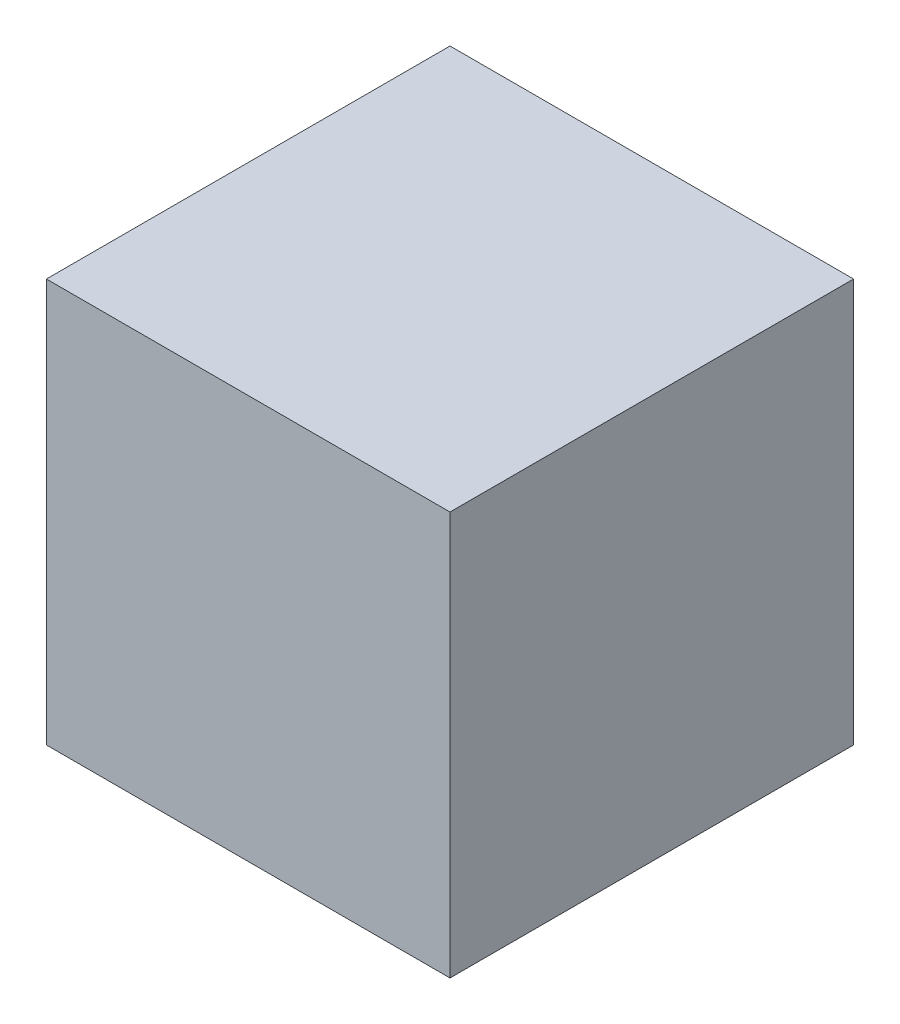
ISO-10303-21;
HEADER;
FILE_DESCRIPTION(('STEP AP214'),'2;1');
FILE_NAME('part.step','',(''),(''),'','','');
FILE_SCHEMA(('AUTOMOTIVE_DESIGN { 1 0 10303 214 1 1 1 1 }'));
ENDSEC;
DATA;
#1=APPLICATION_CONTEXT('core data for automotive mechanical design processes');
#2=APPLICATION_PROTOCOL_DEFINITION('international standard','automotive_design',2000,#1);
#3=PRODUCT_CONTEXT('',#1,'mechanical');
#4=PRODUCT('Part','Part','',(#3));
#5=PRODUCT_RELATED_PRODUCT_CATEGORY('part','',(#4));
#6=PRODUCT_DEFINITION_FORMATION('','',#4);
#7=PRODUCT_DEFINITION_CONTEXT('part definition',#1,'design');
#8=PRODUCT_DEFINITION('design','',#6,#7);
#9=PRODUCT_DEFINITION_SHAPE('','',#8);
#10=(LENGTH_UNIT() NAMED_UNIT(*) SI_UNIT(.MILLI.,.METRE.));
#11=(NAMED_UNIT(*) PLANE_ANGLE_UNIT() SI_UNIT($,.RADIAN.));
#12=(NAMED_UNIT(*) SI_UNIT($,.STERADIAN.) SOLID_ANGLE_UNIT());
#13=UNCERTAINTY_MEASURE_WITH_UNIT(LENGTH_MEASURE(1.E-05),#10,'distance_accuracy_value','');
#14=(GEOMETRIC_REPRESENTATION_CONTEXT(3) GLOBAL_UNCERTAINTY_ASSIGNED_CONTEXT((#13)) GLOBAL_UNIT_ASSIGNED_CONTEXT((#10,
#11,#12)) REPRESENTATION_CONTEXT('',''));
#15=CARTESIAN_POINT('',(0.,0.,0.));
#16=DIRECTION('',(0.,0.,1.));
#17=DIRECTION('',(1.,0.,0.));
#18=AXIS2_PLACEMENT_3D('',#15,#16,#17);
#19=CARTESIAN_POINT('',(-0.127,-0.127,0.));
#20=DIRECTION('',(-1.,0.,0.));
#21=DIRECTION('',(0.,1.,0.));
#22=AXIS2_PLACEMENT_3D('',#19,#20,#21);
#23=PLANE('',#22);
#24=DIRECTION('',(0.,0.,1.));
#25=VECTOR('',#24,1.);
#26=CARTESIAN_POINT('',(-0.127,-0.127,0.));
#27=LINE('',#26,#25);
#28=CARTESIAN_POINT('',(-0.127,-0.127,0.));
#29=VERTEX_POINT('',#28);
#30=CARTESIAN_POINT('',(-0.127,-0.127,0.254));
#31=VERTEX_POINT('',#30);
#32=EDGE_CURVE('E11',#29,#31,#27,.T.);
#33=ORIENTED_EDGE('',*,*,#32,.T.);
#34=DIRECTION('',(0.,1.,0.));
#35=VECTOR('',#34,1.);
#36=CARTESIAN_POINT('',(-0.127,-0.127,0.254));
#37=LINE('',#36,#35);
#38=CARTESIAN_POINT('',(-0.127,0.127,0.254));
#39=VERTEX_POINT('',#38);
#40=EDGE_CURVE('E24',#31,#39,#37,.T.);
#41=ORIENTED_EDGE('',*,*,#40,.T.);
#42=DIRECTION('',(0.,0.,1.));
#43=VECTOR('',#42,1.);
#44=CARTESIAN_POINT('',(-0.127,0.127,0.));
#45=LINE('',#44,#43);
#46=CARTESIAN_POINT('',(-0.127,0.127,0.));
#47=VERTEX_POINT('',#46);
#48=EDGE_CURVE('E85',#47,#39,#45,.T.);
#49=ORIENTED_EDGE('',*,*,#48,.F.);
#50=DIRECTION('',(0.,1.,0.));
#51=VECTOR('',#50,1.);
#52=CARTESIAN_POINT('',(-0.127,-0.127,0.));
#53=LINE('',#52,#51);
#54=EDGE_CURVE('E83',#29,#47,#53,.T.);
#55=ORIENTED_EDGE('',*,*,#54,.F.);
#56=EDGE_LOOP('',(#33,#41,#49,#55));
#57=FACE_BOUND('',#56,.T.);
#58=ADVANCED_FACE('F17',(#57),#23,.T.);
#59=CARTESIAN_POINT('',(-0.127,0.127,0.));
#60=DIRECTION('',(0.,1.,0.));
#61=DIRECTION('',(1.,0.,0.));
#62=AXIS2_PLACEMENT_3D('',#59,#60,#61);
#63=PLANE('',#62);
#64=ORIENTED_EDGE('',*,*,#48,.T.);
#65=DIRECTION('',(1.,0.,0.));
#66=VECTOR('',#65,1.);
#67=CARTESIAN_POINT('',(-0.127,0.127,0.254));
#68=LINE('',#67,#66);
#69=CARTESIAN_POINT('',(0.127,0.127,0.254));
#70=VERTEX_POINT('',#69);
#71=EDGE_CURVE('E81',#39,#70,#68,.T.);
#72=ORIENTED_EDGE('',*,*,#71,.T.);
#73=DIRECTION('',(0.,0.,1.));
#74=VECTOR('',#73,1.);
#75=CARTESIAN_POINT('',(0.127,0.127,0.));
#76=LINE('',#75,#74);
#77=CARTESIAN_POINT('',(0.127,0.127,0.));
#78=VERTEX_POINT('',#77);
#79=EDGE_CURVE('E79',#78,#70,#76,.T.);
#80=ORIENTED_EDGE('',*,*,#79,.F.);
#81=DIRECTION('',(1.,0.,0.));
#82=VECTOR('',#81,1.);
#83=CARTESIAN_POINT('',(-0.127,0.127,0.));
#84=LINE('',#83,#82);
#85=EDGE_CURVE('E70',#47,#78,#84,.T.);
#86=ORIENTED_EDGE('',*,*,#85,.F.);
#87=EDGE_LOOP('',(#64,#72,#80,#86));
#88=FACE_BOUND('',#87,.T.);
#89=ADVANCED_FACE('F90',(#88),#63,.T.);
#90=CARTESIAN_POINT('',(0.127,0.127,0.));
#91=DIRECTION('',(1.,0.,0.));
#92=DIRECTION('',(0.,-1.,0.));
#93=AXIS2_PLACEMENT_3D('',#90,#91,#92);
#94=PLANE('',#93);
#95=ORIENTED_EDGE('',*,*,#79,.T.);
#96=DIRECTION('',(0.,-1.,0.));
#97=VECTOR('',#96,1.);
#98=CARTESIAN_POINT('',(0.127,0.127,0.254));
#99=LINE('',#98,#97);
#100=CARTESIAN_POINT('',(0.127,-0.127,0.254));
#101=VERTEX_POINT('',#100);
#102=EDGE_CURVE('E60',#70,#101,#99,.T.);
#103=ORIENTED_EDGE('',*,*,#102,.T.);
#104=DIRECTION('',(0.,0.,1.));
#105=VECTOR('',#104,1.);
#106=CARTESIAN_POINT('',(0.127,-0.127,0.));
#107=LINE('',#106,#105);
#108=CARTESIAN_POINT('',(0.127,-0.127,0.));
#109=VERTEX_POINT('',#108);
#110=EDGE_CURVE('E54',#109,#101,#107,.T.);
#111=ORIENTED_EDGE('',*,*,#110,.F.);
#112=DIRECTION('',(0.,-1.,0.));
#113=VECTOR('',#112,1.);
#114=CARTESIAN_POINT('',(0.127,0.127,0.));
#115=LINE('',#114,#113);
#116=EDGE_CURVE('E58',#78,#109,#115,.T.);
#117=ORIENTED_EDGE('',*,*,#116,.F.);
#118=EDGE_LOOP('',(#95,#103,#111,#117));
#119=FACE_BOUND('',#118,.T.);
#120=ADVANCED_FACE('F57',(#119),#94,.T.);
#121=CARTESIAN_POINT('',(0.127,-0.127,0.));
#122=DIRECTION('',(0.,-1.,0.));
#123=DIRECTION('',(-1.,0.,0.));
#124=AXIS2_PLACEMENT_3D('',#121,#122,#123);
#125=PLANE('',#124);
#126=ORIENTED_EDGE('',*,*,#110,.T.);
#127=DIRECTION('',(-1.,0.,0.));
#128=VECTOR('',#127,1.);
#129=CARTESIAN_POINT('',(0.127,-0.127,0.254));
#130=LINE('',#129,#128);
#131=EDGE_CURVE('E71',#101,#31,#130,.T.);
#132=ORIENTED_EDGE('',*,*,#131,.T.);
#133=ORIENTED_EDGE('',*,*,#32,.F.);
#134=DIRECTION('',(-1.,0.,0.));
#135=VECTOR('',#134,1.);
#136=CARTESIAN_POINT('',(0.127,-0.127,0.));
#137=LINE('',#136,#135);
#138=EDGE_CURVE('E68',#109,#29,#137,.T.);
#139=ORIENTED_EDGE('',*,*,#138,.F.);
#140=EDGE_LOOP('',(#126,#132,#133,#139));
#141=FACE_BOUND('',#140,.T.);
#142=ADVANCED_FACE('F73',(#141),#125,.T.);
#143=CARTESIAN_POINT('',(0.,0.,0.));
#144=DIRECTION('',(0.,0.,-1.));
#145=DIRECTION('',(-1.,0.,0.));
#146=AXIS2_PLACEMENT_3D('',#143,#144,#145);
#147=PLANE('',#146);
#148=ORIENTED_EDGE('',*,*,#54,.T.);
#149=ORIENTED_EDGE('',*,*,#85,.T.);
#150=ORIENTED_EDGE('',*,*,#116,.T.);
#151=ORIENTED_EDGE('',*,*,#138,.T.);
#152=EDGE_LOOP('',(#148,#149,#150,#151));
#153=FACE_BOUND('',#152,.T.);
#154=ADVANCED_FACE('F67',(#153),#147,.T.);
#155=CARTESIAN_POINT('',(0.,0.,0.254));
#156=DIRECTION('',(0.,0.,-1.));
#157=DIRECTION('',(-1.,0.,0.));
#158=AXIS2_PLACEMENT_3D('',#155,#156,#157);
#159=PLANE('',#158);
#160=ORIENTED_EDGE('',*,*,#131,.F.);
#161=ORIENTED_EDGE('',*,*,#102,.F.);
#162=ORIENTED_EDGE('',*,*,#71,.F.);
#163=ORIENTED_EDGE('',*,*,#40,.F.);
#164=EDGE_LOOP('',(#160,#161,#162,#163));
#165=FACE_BOUND('',#164,.T.);
#166=ADVANCED_FACE('F91',(#165),#159,.F.);
#167=CLOSED_SHELL('',(#58,#89,#120,#142,#154,#166));
#168=MANIFOLD_SOLID_BREP('B1',#167);
#169=ADVANCED_BREP_SHAPE_REPRESENTATION('',(#18,#168),#14);
#170=SHAPE_DEFINITION_REPRESENTATION(#9,#169);
ENDSEC;
END-ISO-10303-21;
